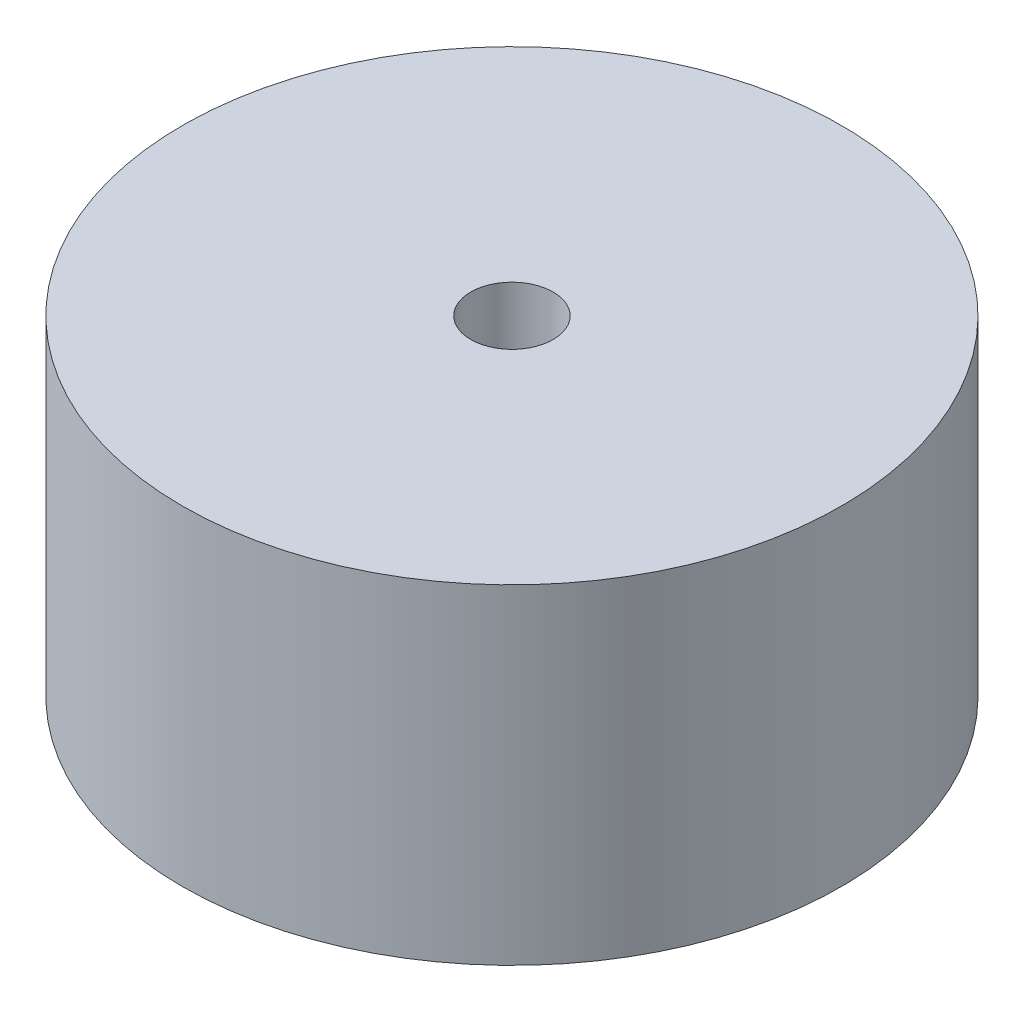
ISO-10303-21;
HEADER;
FILE_DESCRIPTION(('STEP AP214'),'2;1');
FILE_NAME('part.step','',(''),(''),'','','');
FILE_SCHEMA(('AUTOMOTIVE_DESIGN { 1 0 10303 214 1 1 1 1 }'));
ENDSEC;
DATA;
#1=APPLICATION_CONTEXT('core data for automotive mechanical design processes');
#2=APPLICATION_PROTOCOL_DEFINITION('international standard','automotive_design',2000,#1);
#3=PRODUCT_CONTEXT('',#1,'mechanical');
#4=PRODUCT('Part','Part','',(#3));
#5=PRODUCT_RELATED_PRODUCT_CATEGORY('part','',(#4));
#6=PRODUCT_DEFINITION_FORMATION('','',#4);
#7=PRODUCT_DEFINITION_CONTEXT('part definition',#1,'design');
#8=PRODUCT_DEFINITION('design','',#6,#7);
#9=PRODUCT_DEFINITION_SHAPE('','',#8);
#10=(LENGTH_UNIT() NAMED_UNIT(*) SI_UNIT(.MILLI.,.METRE.));
#11=(NAMED_UNIT(*) PLANE_ANGLE_UNIT() SI_UNIT($,.RADIAN.));
#12=(NAMED_UNIT(*) SI_UNIT($,.STERADIAN.) SOLID_ANGLE_UNIT());
#13=UNCERTAINTY_MEASURE_WITH_UNIT(LENGTH_MEASURE(1.E-05),#10,'distance_accuracy_value','');
#14=(GEOMETRIC_REPRESENTATION_CONTEXT(3) GLOBAL_UNCERTAINTY_ASSIGNED_CONTEXT((#13)) GLOBAL_UNIT_ASSIGNED_CONTEXT((#10,
#11,#12)) REPRESENTATION_CONTEXT('',''));
#15=CARTESIAN_POINT('',(0.,0.,0.));
#16=DIRECTION('',(0.,0.,1.));
#17=DIRECTION('',(1.,0.,0.));
#18=AXIS2_PLACEMENT_3D('',#15,#16,#17);
#19=CARTESIAN_POINT('',(0.,20.,0.));
#20=DIRECTION('',(0.,-1.,0.));
#21=DIRECTION('',(0.,0.,-1.));
#22=AXIS2_PLACEMENT_3D('',#19,#20,#21);
#23=CYLINDRICAL_SURFACE('',#22,20.);
#24=CARTESIAN_POINT('',(0.,20.,0.));
#25=DIRECTION('',(0.,1.,0.));
#26=DIRECTION('',(0.,0.,1.));
#27=AXIS2_PLACEMENT_3D('',#24,#25,#26);
#28=CIRCLE('',#27,20.);
#29=CARTESIAN_POINT('',(0.,20.,20.));
#30=VERTEX_POINT('',#29);
#31=EDGE_CURVE('E10',#30,#30,#28,.T.);
#32=ORIENTED_EDGE('',*,*,#31,.F.);
#33=EDGE_LOOP('',(#32));
#34=FACE_BOUND('',#33,.T.);
#35=CARTESIAN_POINT('',(0.,0.,0.));
#36=DIRECTION('',(0.,1.,0.));
#37=DIRECTION('',(0.,0.,1.));
#38=AXIS2_PLACEMENT_3D('',#35,#36,#37);
#39=CIRCLE('',#38,20.);
#40=CARTESIAN_POINT('',(0.,0.,20.));
#41=VERTEX_POINT('',#40);
#42=EDGE_CURVE('E38',#41,#41,#39,.T.);
#43=ORIENTED_EDGE('',*,*,#42,.T.);
#44=EDGE_LOOP('',(#43));
#45=FACE_BOUND('',#44,.T.);
#46=ADVANCED_FACE('F35',(#34,#45),#23,.T.);
#47=CARTESIAN_POINT('',(0.,20.,0.));
#48=DIRECTION('',(0.,1.,0.));
#49=DIRECTION('',(0.,0.,1.));
#50=AXIS2_PLACEMENT_3D('',#47,#48,#49);
#51=PLANE('',#50);
#52=CARTESIAN_POINT('',(0.,20.,0.));
#53=DIRECTION('',(0.,1.,0.));
#54=DIRECTION('',(0.,0.,1.));
#55=AXIS2_PLACEMENT_3D('',#52,#53,#54);
#56=CIRCLE('',#55,2.5);
#57=CARTESIAN_POINT('',(0.,20.,2.5));
#58=VERTEX_POINT('',#57);
#59=EDGE_CURVE('E47',#58,#58,#56,.T.);
#60=ORIENTED_EDGE('',*,*,#59,.F.);
#61=EDGE_LOOP('',(#60));
#62=FACE_BOUND('',#61,.T.);
#63=ORIENTED_EDGE('',*,*,#31,.T.);
#64=EDGE_LOOP('',(#63));
#65=FACE_BOUND('',#64,.T.);
#66=ADVANCED_FACE('F85',(#62,#65),#51,.T.);
#67=CARTESIAN_POINT('',(0.,0.,0.));
#68=DIRECTION('',(0.,1.,0.));
#69=DIRECTION('',(0.,0.,1.));
#70=AXIS2_PLACEMENT_3D('',#67,#68,#69);
#71=PLANE('',#70);
#72=CARTESIAN_POINT('',(0.,0.,0.));
#73=DIRECTION('',(0.,-1.,0.));
#74=DIRECTION('',(0.,0.,-1.));
#75=AXIS2_PLACEMENT_3D('',#72,#73,#74);
#76=CIRCLE('',#75,18.);
#77=CARTESIAN_POINT('',(0.,0.,-18.));
#78=VERTEX_POINT('',#77);
#79=EDGE_CURVE('E53',#78,#78,#76,.T.);
#80=ORIENTED_EDGE('',*,*,#79,.F.);
#81=EDGE_LOOP('',(#80));
#82=FACE_BOUND('',#81,.T.);
#83=ORIENTED_EDGE('',*,*,#42,.F.);
#84=EDGE_LOOP('',(#83));
#85=FACE_BOUND('',#84,.T.);
#86=ADVANCED_FACE('F81',(#82,#85),#71,.F.);
#87=CARTESIAN_POINT('',(0.,10.,0.));
#88=DIRECTION('',(0.,1.,0.));
#89=DIRECTION('',(0.,0.,1.));
#90=AXIS2_PLACEMENT_3D('',#87,#88,#89);
#91=CYLINDRICAL_SURFACE('',#90,2.5);
#92=CARTESIAN_POINT('',(0.,10.,0.));
#93=DIRECTION('',(0.,1.,0.));
#94=DIRECTION('',(0.,0.,1.));
#95=AXIS2_PLACEMENT_3D('',#92,#93,#94);
#96=CIRCLE('',#95,2.5);
#97=CARTESIAN_POINT('',(0.,10.,2.5));
#98=VERTEX_POINT('',#97);
#99=EDGE_CURVE('E45',#98,#98,#96,.T.);
#100=ORIENTED_EDGE('',*,*,#99,.F.);
#101=EDGE_LOOP('',(#100));
#102=FACE_BOUND('',#101,.T.);
#103=ORIENTED_EDGE('',*,*,#59,.T.);
#104=EDGE_LOOP('',(#103));
#105=FACE_BOUND('',#104,.T.);
#106=ADVANCED_FACE('F84',(#102,#105),#91,.F.);
#107=CARTESIAN_POINT('',(0.,10.,0.));
#108=DIRECTION('',(0.,1.,0.));
#109=DIRECTION('',(0.,0.,1.));
#110=AXIS2_PLACEMENT_3D('',#107,#108,#109);
#111=PLANE('',#110);
#112=ORIENTED_EDGE('',*,*,#99,.T.);
#113=EDGE_LOOP('',(#112));
#114=FACE_BOUND('',#113,.T.);
#115=ADVANCED_FACE('F77',(#114),#111,.T.);
#116=CARTESIAN_POINT('',(0.,2.,0.));
#117=DIRECTION('',(0.,-1.,0.));
#118=DIRECTION('',(0.,0.,-1.));
#119=AXIS2_PLACEMENT_3D('',#116,#117,#118);
#120=CYLINDRICAL_SURFACE('',#119,18.);
#121=CARTESIAN_POINT('',(0.,2.,0.));
#122=DIRECTION('',(0.,-1.,0.));
#123=DIRECTION('',(0.,0.,-1.));
#124=AXIS2_PLACEMENT_3D('',#121,#122,#123);
#125=CIRCLE('',#124,18.);
#126=CARTESIAN_POINT('',(0.,2.,-18.));
#127=VERTEX_POINT('',#126);
#128=EDGE_CURVE('E50',#127,#127,#125,.T.);
#129=ORIENTED_EDGE('',*,*,#128,.F.);
#130=EDGE_LOOP('',(#129));
#131=FACE_BOUND('',#130,.T.);
#132=ORIENTED_EDGE('',*,*,#79,.T.);
#133=EDGE_LOOP('',(#132));
#134=FACE_BOUND('',#133,.T.);
#135=ADVANCED_FACE('F71',(#131,#134),#120,.F.);
#136=CARTESIAN_POINT('',(0.,2.,0.));
#137=DIRECTION('',(0.,-1.,0.));
#138=DIRECTION('',(0.,0.,-1.));
#139=AXIS2_PLACEMENT_3D('',#136,#137,#138);
#140=PLANE('',#139);
#141=CARTESIAN_POINT('',(0.,2.,0.));
#142=DIRECTION('',(0.,-1.,0.));
#143=DIRECTION('',(0.,0.,-1.));
#144=AXIS2_PLACEMENT_3D('',#141,#142,#143);
#145=CIRCLE('',#144,9.);
#146=CARTESIAN_POINT('',(0.,2.,-9.));
#147=VERTEX_POINT('',#146);
#148=EDGE_CURVE('E56',#147,#147,#145,.T.);
#149=ORIENTED_EDGE('',*,*,#148,.F.);
#150=EDGE_LOOP('',(#149));
#151=FACE_BOUND('',#150,.T.);
#152=ORIENTED_EDGE('',*,*,#128,.T.);
#153=EDGE_LOOP('',(#152));
#154=FACE_BOUND('',#153,.T.);
#155=ADVANCED_FACE('F68',(#151,#154),#140,.T.);
#156=CARTESIAN_POINT('',(0.,2.,0.));
#157=DIRECTION('',(0.,-1.,0.));
#158=DIRECTION('',(0.,0.,-1.));
#159=AXIS2_PLACEMENT_3D('',#156,#157,#158);
#160=CYLINDRICAL_SURFACE('',#159,9.);
#161=ORIENTED_EDGE('',*,*,#148,.T.);
#162=EDGE_LOOP('',(#161));
#163=FACE_BOUND('',#162,.T.);
#164=CARTESIAN_POINT('',(0.,0.,0.));
#165=DIRECTION('',(0.,-1.,0.));
#166=DIRECTION('',(0.,0.,-1.));
#167=AXIS2_PLACEMENT_3D('',#164,#165,#166);
#168=CIRCLE('',#167,9.);
#169=CARTESIAN_POINT('',(0.,0.,-9.));
#170=VERTEX_POINT('',#169);
#171=EDGE_CURVE('E59',#170,#170,#168,.T.);
#172=ORIENTED_EDGE('',*,*,#171,.F.);
#173=EDGE_LOOP('',(#172));
#174=FACE_BOUND('',#173,.T.);
#175=ADVANCED_FACE('F65',(#163,#174),#160,.T.);
#176=ORIENTED_EDGE('',*,*,#171,.T.);
#177=EDGE_LOOP('',(#176));
#178=FACE_BOUND('',#177,.T.);
#179=ADVANCED_FACE('F86',(#178),#71,.F.);
#180=CLOSED_SHELL('',(#46,#66,#86,#106,#115,#135,#155,#175,#179));
#181=MANIFOLD_SOLID_BREP('B2',#180);
#182=ADVANCED_BREP_SHAPE_REPRESENTATION('',(#18,#181),#14);
#183=SHAPE_DEFINITION_REPRESENTATION(#9,#182);
ENDSEC;
END-ISO-10303-21;
